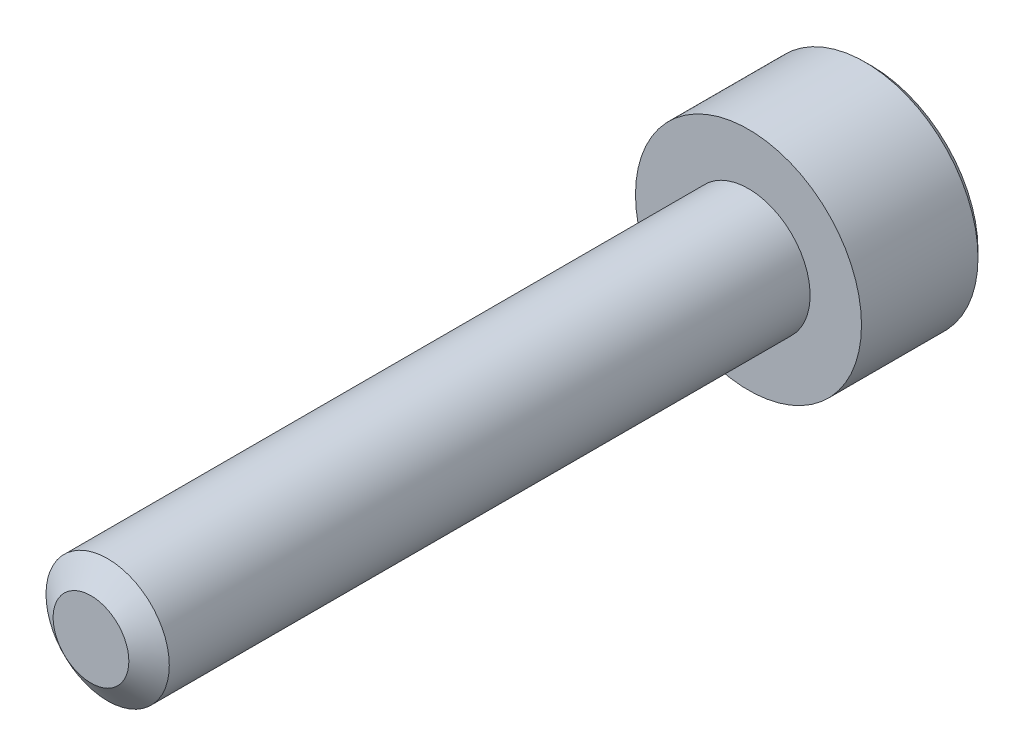
ISO-10303-21;
HEADER;
FILE_DESCRIPTION(('STEP AP214'),'2;1');
FILE_NAME('part.step','',(''),(''),'','','');
FILE_SCHEMA(('AUTOMOTIVE_DESIGN { 1 0 10303 214 1 1 1 1 }'));
ENDSEC;
DATA;
#1=APPLICATION_CONTEXT('core data for automotive mechanical design processes');
#2=APPLICATION_PROTOCOL_DEFINITION('international standard','automotive_design',2000,#1);
#3=PRODUCT_CONTEXT('',#1,'mechanical');
#4=PRODUCT('Part','Part','',(#3));
#5=PRODUCT_RELATED_PRODUCT_CATEGORY('part','',(#4));
#6=PRODUCT_DEFINITION_FORMATION('','',#4);
#7=PRODUCT_DEFINITION_CONTEXT('part definition',#1,'design');
#8=PRODUCT_DEFINITION('design','',#6,#7);
#9=PRODUCT_DEFINITION_SHAPE('','',#8);
#10=(LENGTH_UNIT() NAMED_UNIT(*) SI_UNIT(.MILLI.,.METRE.));
#11=(NAMED_UNIT(*) PLANE_ANGLE_UNIT() SI_UNIT($,.RADIAN.));
#12=(NAMED_UNIT(*) SI_UNIT($,.STERADIAN.) SOLID_ANGLE_UNIT());
#13=UNCERTAINTY_MEASURE_WITH_UNIT(LENGTH_MEASURE(1.E-05),#10,'distance_accuracy_value','');
#14=(GEOMETRIC_REPRESENTATION_CONTEXT(3) GLOBAL_UNCERTAINTY_ASSIGNED_CONTEXT((#13)) GLOBAL_UNIT_ASSIGNED_CONTEXT((#10,
#11,#12)) REPRESENTATION_CONTEXT('',''));
#15=CARTESIAN_POINT('',(0.,0.,0.));
#16=DIRECTION('',(0.,0.,1.));
#17=DIRECTION('',(1.,0.,0.));
#18=AXIS2_PLACEMENT_3D('',#15,#16,#17);
#19=CARTESIAN_POINT('',(0.,0.,4.));
#20=DIRECTION('',(0.,0.,1.));
#21=DIRECTION('',(0.,-1.,0.));
#22=AXIS2_PLACEMENT_3D('',#19,#20,#21);
#23=PLANE('',#22);
#24=CARTESIAN_POINT('',(0.,0.,4.));
#25=DIRECTION('',(0.,0.,1.));
#26=DIRECTION('',(1.,0.,0.));
#27=AXIS2_PLACEMENT_3D('',#24,#25,#26);
#28=CIRCLE('',#27,0.921240473580834);
#29=CARTESIAN_POINT('',(0.921240473580836,0.,4.));
#30=VERTEX_POINT('',#29);
#31=EDGE_CURVE('E11',#30,#30,#28,.T.);
#32=ORIENTED_EDGE('',*,*,#31,.T.);
#33=EDGE_LOOP('',(#32));
#34=FACE_BOUND('',#33,.T.);
#35=ADVANCED_FACE('F16',(#34),#23,.T.);
#36=CARTESIAN_POINT('',(0.,0.,4.));
#37=DIRECTION('',(0.,0.,-1.));
#38=DIRECTION('',(-1.,0.,0.));
#39=AXIS2_PLACEMENT_3D('',#36,#37,#38);
#40=CONICAL_SURFACE('',#39,0.921240473580834,0.959931088596884);
#41=CARTESIAN_POINT('',(0.,0.,3.59474821679062));
#42=DIRECTION('',(0.,0.,-1.));
#43=DIRECTION('',(1.,0.,0.));
#44=AXIS2_PLACEMENT_3D('',#41,#42,#43);
#45=CIRCLE('',#44,1.5);
#46=CARTESIAN_POINT('',(-1.5,0.,3.59474821679062));
#47=VERTEX_POINT('',#46);
#48=CARTESIAN_POINT('',(1.5,0.,3.59474821679062));
#49=VERTEX_POINT('',#48);
#50=EDGE_CURVE('E251',#47,#49,#45,.T.);
#51=ORIENTED_EDGE('',*,*,#50,.F.);
#52=CARTESIAN_POINT('',(0.,0.,3.59474821679062));
#53=DIRECTION('',(0.,0.,-1.));
#54=DIRECTION('',(1.,0.,0.));
#55=AXIS2_PLACEMENT_3D('',#52,#53,#54);
#56=CIRCLE('',#55,1.5);
#57=EDGE_CURVE('E255',#49,#47,#56,.T.);
#58=ORIENTED_EDGE('',*,*,#57,.F.);
#59=DIRECTION('',(-0.819152044288993,0.,0.573576436351044));
#60=VECTOR('',#59,1.);
#61=CARTESIAN_POINT('',(0.921240473580836,0.,4.));
#62=LINE('',#61,#60);
#63=EDGE_CURVE('E24',#49,#30,#62,.T.);
#64=ORIENTED_EDGE('',*,*,#63,.T.);
#65=ORIENTED_EDGE('',*,*,#31,.F.);
#66=ORIENTED_EDGE('',*,*,#63,.F.);
#67=EDGE_LOOP('',(#51,#58,#64,#65,#66));
#68=FACE_BOUND('',#67,.T.);
#69=ADVANCED_FACE('F265',(#68),#40,.T.);
#70=CARTESIAN_POINT('',(0.,0.,-12.));
#71=DIRECTION('',(0.,0.,1.));
#72=DIRECTION('',(1.,0.,0.));
#73=AXIS2_PLACEMENT_3D('',#70,#71,#72);
#74=CYLINDRICAL_SURFACE('',#73,1.5);
#75=ORIENTED_EDGE('',*,*,#50,.T.);
#76=ORIENTED_EDGE('',*,*,#57,.T.);
#77=DIRECTION('',(0.,0.,-1.));
#78=VECTOR('',#77,1.);
#79=CARTESIAN_POINT('',(-1.5,0.,-12.));
#80=LINE('',#79,#78);
#81=CARTESIAN_POINT('',(-1.5,0.,-12.));
#82=VERTEX_POINT('',#81);
#83=EDGE_CURVE('E261',#47,#82,#80,.T.);
#84=ORIENTED_EDGE('',*,*,#83,.T.);
#85=CARTESIAN_POINT('',(0.,0.,-12.));
#86=DIRECTION('',(0.,0.,1.));
#87=DIRECTION('',(1.,0.,0.));
#88=AXIS2_PLACEMENT_3D('',#85,#86,#87);
#89=CIRCLE('',#88,1.5);
#90=EDGE_CURVE('E239',#82,#82,#89,.T.);
#91=ORIENTED_EDGE('',*,*,#90,.T.);
#92=ORIENTED_EDGE('',*,*,#83,.F.);
#93=EDGE_LOOP('',(#75,#76,#84,#91,#92));
#94=FACE_BOUND('',#93,.T.);
#95=ADVANCED_FACE('F267',(#94),#74,.T.);
#96=CARTESIAN_POINT('',(0.,0.,-15.));
#97=DIRECTION('',(0.,0.,1.));
#98=DIRECTION('',(1.,0.,0.));
#99=AXIS2_PLACEMENT_3D('',#96,#97,#98);
#100=CONICAL_SURFACE('',#99,2.585,0.785398163397446);
#101=CARTESIAN_POINT('',(0.,0.,-14.835));
#102=DIRECTION('',(0.,0.,1.));
#103=DIRECTION('',(-1.,0.,0.));
#104=AXIS2_PLACEMENT_3D('',#101,#102,#103);
#105=CIRCLE('',#104,2.75);
#106=CARTESIAN_POINT('',(-2.75,0.,-14.835));
#107=VERTEX_POINT('',#106);
#108=EDGE_CURVE('E118',#107,#107,#105,.T.);
#109=ORIENTED_EDGE('',*,*,#108,.F.);
#110=DIRECTION('',(0.707106781186546,0.,-0.707106781186549));
#111=VECTOR('',#110,1.);
#112=CARTESIAN_POINT('',(-2.585,0.,-15.));
#113=LINE('',#112,#111);
#114=CARTESIAN_POINT('',(-2.585,0.,-15.));
#115=VERTEX_POINT('',#114);
#116=EDGE_CURVE('E250',#107,#115,#113,.T.);
#117=ORIENTED_EDGE('',*,*,#116,.T.);
#118=CARTESIAN_POINT('',(0.,0.,-15.));
#119=DIRECTION('',(0.,0.,-1.));
#120=DIRECTION('',(-1.,0.,0.));
#121=AXIS2_PLACEMENT_3D('',#118,#119,#120);
#122=CIRCLE('',#121,2.585);
#123=EDGE_CURVE('E243',#115,#115,#122,.T.);
#124=ORIENTED_EDGE('',*,*,#123,.F.);
#125=ORIENTED_EDGE('',*,*,#116,.F.);
#126=EDGE_LOOP('',(#109,#117,#124,#125));
#127=FACE_BOUND('',#126,.T.);
#128=ADVANCED_FACE('F294',(#127),#100,.T.);
#129=CARTESIAN_POINT('',(0.,0.,-15.));
#130=DIRECTION('',(0.,0.,-1.));
#131=DIRECTION('',(-1.,0.,0.));
#132=AXIS2_PLACEMENT_3D('',#129,#130,#131);
#133=CONICAL_SURFACE('',#132,1.44337567297406,0.78539816339745);
#134=CARTESIAN_POINT('',(-1.25,-0.72168783648703,-15.));
#135=CARTESIAN_POINT('',(-1.25,0.,-14.6391560817565));
#136=CARTESIAN_POINT('',(-1.25,0.721687836487026,-15.));
#137=(BOUNDED_CURVE() B_SPLINE_CURVE(2,(#134,#135,#136),.UNSPECIFIED.,.F.,
.F.) B_SPLINE_CURVE_WITH_KNOTS((3,3),(-0.355324362692751,-0.127655147271297),
.UNSPECIFIED.) CURVE() GEOMETRIC_REPRESENTATION_ITEM() RATIONAL_B_SPLINE_CURVE((1.37128129211021,
1.58341924626905,1.37128129211021)) REPRESENTATION_ITEM(''));
#138=CARTESIAN_POINT('',(-1.25,-0.721687836487032,-15.));
#139=VERTEX_POINT('',#138);
#140=CARTESIAN_POINT('',(-1.25,0.721687836487032,-15.));
#141=VERTEX_POINT('',#140);
#142=EDGE_CURVE('E175',#139,#141,#137,.T.);
#143=ORIENTED_EDGE('',*,*,#142,.F.);
#144=CARTESIAN_POINT('',(0.,0.,-15.));
#145=DIRECTION('',(0.,0.,-1.));
#146=DIRECTION('',(-1.,0.,0.));
#147=AXIS2_PLACEMENT_3D('',#144,#145,#146);
#148=CIRCLE('',#147,1.44337567297406);
#149=EDGE_CURVE('E247',#139,#141,#148,.T.);
#150=ORIENTED_EDGE('',*,*,#149,.T.);
#151=EDGE_LOOP('',(#143,#150));
#152=FACE_BOUND('',#151,.T.);
#153=ADVANCED_FACE('F282',(#152),#133,.F.);
#154=CARTESIAN_POINT('',(0.,0.,-15.));
#155=DIRECTION('',(0.,0.,-1.));
#156=DIRECTION('',(0.,-1.,0.));
#157=AXIS2_PLACEMENT_3D('',#154,#155,#156);
#158=PLANE('',#157);
#159=CARTESIAN_POINT('',(0.,0.,-15.));
#160=DIRECTION('',(0.,0.,-1.));
#161=DIRECTION('',(-1.,0.,0.));
#162=AXIS2_PLACEMENT_3D('',#159,#160,#161);
#163=CIRCLE('',#162,1.44337567297406);
#164=CARTESIAN_POINT('',(0.,1.44337567297407,-15.));
#165=VERTEX_POINT('',#164);
#166=EDGE_CURVE('E190',#141,#165,#163,.T.);
#167=ORIENTED_EDGE('',*,*,#166,.F.);
#168=ORIENTED_EDGE('',*,*,#149,.F.);
#169=CARTESIAN_POINT('',(0.,0.,-15.));
#170=DIRECTION('',(0.,0.,-1.));
#171=DIRECTION('',(-1.,0.,0.));
#172=AXIS2_PLACEMENT_3D('',#169,#170,#171);
#173=CIRCLE('',#172,1.44337567297406);
#174=CARTESIAN_POINT('',(0.,-1.44337567297407,-15.));
#175=VERTEX_POINT('',#174);
#176=EDGE_CURVE('E182',#175,#139,#173,.T.);
#177=ORIENTED_EDGE('',*,*,#176,.F.);
#178=CARTESIAN_POINT('',(0.,0.,-15.));
#179=DIRECTION('',(0.,0.,-1.));
#180=DIRECTION('',(-1.,0.,0.));
#181=AXIS2_PLACEMENT_3D('',#178,#179,#180);
#182=CIRCLE('',#181,1.44337567297406);
#183=CARTESIAN_POINT('',(1.25,-0.721687836487032,-15.));
#184=VERTEX_POINT('',#183);
#185=EDGE_CURVE('E189',#184,#175,#182,.T.);
#186=ORIENTED_EDGE('',*,*,#185,.F.);
#187=CARTESIAN_POINT('',(0.,0.,-15.));
#188=DIRECTION('',(0.,0.,-1.));
#189=DIRECTION('',(-1.,0.,0.));
#190=AXIS2_PLACEMENT_3D('',#187,#188,#189);
#191=CIRCLE('',#190,1.44337567297406);
#192=CARTESIAN_POINT('',(1.25,0.721687836487033,-15.));
#193=VERTEX_POINT('',#192);
#194=EDGE_CURVE('E233',#193,#184,#191,.T.);
#195=ORIENTED_EDGE('',*,*,#194,.F.);
#196=CARTESIAN_POINT('',(0.,0.,-15.));
#197=DIRECTION('',(0.,0.,-1.));
#198=DIRECTION('',(-1.,0.,0.));
#199=AXIS2_PLACEMENT_3D('',#196,#197,#198);
#200=CIRCLE('',#199,1.44337567297406);
#201=EDGE_CURVE('E236',#165,#193,#200,.T.);
#202=ORIENTED_EDGE('',*,*,#201,.F.);
#203=EDGE_LOOP('',(#167,#168,#177,#186,#195,#202));
#204=FACE_BOUND('',#203,.T.);
#205=ORIENTED_EDGE('',*,*,#123,.T.);
#206=EDGE_LOOP('',(#205));
#207=FACE_BOUND('',#206,.T.);
#208=ADVANCED_FACE('F272',(#204,#207),#158,.T.);
#209=CARTESIAN_POINT('',(0.,0.,-12.));
#210=DIRECTION('',(0.,0.,-1.));
#211=DIRECTION('',(0.,-1.,0.));
#212=AXIS2_PLACEMENT_3D('',#209,#210,#211);
#213=PLANE('',#212);
#214=ORIENTED_EDGE('',*,*,#90,.F.);
#215=EDGE_LOOP('',(#214));
#216=FACE_BOUND('',#215,.T.);
#217=CARTESIAN_POINT('',(0.,0.,-12.));
#218=DIRECTION('',(0.,0.,1.));
#219=DIRECTION('',(1.,0.,0.));
#220=AXIS2_PLACEMENT_3D('',#217,#218,#219);
#221=CIRCLE('',#220,2.75);
#222=CARTESIAN_POINT('',(-2.75,0.,-12.));
#223=VERTEX_POINT('',#222);
#224=EDGE_CURVE('E116',#223,#223,#221,.T.);
#225=ORIENTED_EDGE('',*,*,#224,.T.);
#226=EDGE_LOOP('',(#225));
#227=FACE_BOUND('',#226,.T.);
#228=ADVANCED_FACE('F122',(#216,#227),#213,.F.);
#229=CARTESIAN_POINT('',(0.,0.,-15.));
#230=DIRECTION('',(0.,0.,-1.));
#231=DIRECTION('',(-1.,0.,0.));
#232=AXIS2_PLACEMENT_3D('',#229,#230,#231);
#233=CONICAL_SURFACE('',#232,1.44337567297406,0.78539816339745);
#234=ORIENTED_EDGE('',*,*,#201,.T.);
#235=CARTESIAN_POINT('',(0.,1.44337567297406,-15.));
#236=CARTESIAN_POINT('',(0.625000000000001,1.08253175473055,-14.6391560817565));
#237=CARTESIAN_POINT('',(1.25,0.721687836487035,-15.));
#238=(BOUNDED_CURVE() B_SPLINE_CURVE(2,(#235,#236,#237),.UNSPECIFIED.,.F.,
.F.) B_SPLINE_CURVE_WITH_KNOTS((3,3),(-0.35532436269275,-0.127655147271297),
.UNSPECIFIED.) CURVE() GEOMETRIC_REPRESENTATION_ITEM() RATIONAL_B_SPLINE_CURVE((1.37128129211021,
1.58341924626904,1.3712812921102)) REPRESENTATION_ITEM(''));
#239=EDGE_CURVE('E170',#165,#193,#238,.T.);
#240=ORIENTED_EDGE('',*,*,#239,.F.);
#241=EDGE_LOOP('',(#234,#240));
#242=FACE_BOUND('',#241,.T.);
#243=ADVANCED_FACE('F271',(#242),#233,.F.);
#244=CARTESIAN_POINT('',(0.,0.,-15.));
#245=DIRECTION('',(0.,0.,-1.));
#246=DIRECTION('',(1.,0.,0.));
#247=AXIS2_PLACEMENT_3D('',#244,#245,#246);
#248=CONICAL_SURFACE('',#247,1.44337567297406,0.78539816339745);
#249=ORIENTED_EDGE('',*,*,#194,.T.);
#250=CARTESIAN_POINT('',(1.25,0.721687836487025,-15.));
#251=CARTESIAN_POINT('',(1.25,0.,-14.6391560817565));
#252=CARTESIAN_POINT('',(1.25,-0.721687836487027,-15.));
#253=(BOUNDED_CURVE() B_SPLINE_CURVE(2,(#250,#251,#252),.UNSPECIFIED.,.F.,
.F.) B_SPLINE_CURVE_WITH_KNOTS((3,3),(-0.35532436269275,-0.127655147271297),
.UNSPECIFIED.) CURVE() GEOMETRIC_REPRESENTATION_ITEM() RATIONAL_B_SPLINE_CURVE((1.3712812921102,
1.58341924626904,1.3712812921102)) REPRESENTATION_ITEM(''));
#254=EDGE_CURVE('E171',#193,#184,#253,.T.);
#255=ORIENTED_EDGE('',*,*,#254,.F.);
#256=EDGE_LOOP('',(#249,#255));
#257=FACE_BOUND('',#256,.T.);
#258=ADVANCED_FACE('F279',(#257),#248,.F.);
#259=CARTESIAN_POINT('',(0.,0.,-15.));
#260=DIRECTION('',(0.,0.,-1.));
#261=DIRECTION('',(-1.,0.,0.));
#262=AXIS2_PLACEMENT_3D('',#259,#260,#261);
#263=CONICAL_SURFACE('',#262,1.44337567297406,0.78539816339745);
#264=ORIENTED_EDGE('',*,*,#185,.T.);
#265=CARTESIAN_POINT('',(1.25,-0.721687836487034,-15.));
#266=CARTESIAN_POINT('',(0.625000000000001,-1.08253175473055,-14.6391560817565));
#267=CARTESIAN_POINT('',(0.,-1.44337567297406,-15.));
#268=(BOUNDED_CURVE() B_SPLINE_CURVE(2,(#265,#266,#267),.UNSPECIFIED.,.F.,
.F.) B_SPLINE_CURVE_WITH_KNOTS((3,3),(-0.355324362692751,-0.127655147271297),
.UNSPECIFIED.) CURVE() GEOMETRIC_REPRESENTATION_ITEM() RATIONAL_B_SPLINE_CURVE((1.37128129211021,
1.58341924626905,1.37128129211021)) REPRESENTATION_ITEM(''));
#269=EDGE_CURVE('E128',#184,#175,#268,.T.);
#270=ORIENTED_EDGE('',*,*,#269,.F.);
#271=EDGE_LOOP('',(#264,#270));
#272=FACE_BOUND('',#271,.T.);
#273=ADVANCED_FACE('F302',(#272),#263,.F.);
#274=CARTESIAN_POINT('',(0.,0.,-15.));
#275=DIRECTION('',(0.,0.,-1.));
#276=DIRECTION('',(-1.,0.,0.));
#277=AXIS2_PLACEMENT_3D('',#274,#275,#276);
#278=CONICAL_SURFACE('',#277,1.44337567297406,0.78539816339745);
#279=ORIENTED_EDGE('',*,*,#176,.T.);
#280=CARTESIAN_POINT('',(0.,-1.44337567297406,-15.));
#281=CARTESIAN_POINT('',(-0.625000000000001,-1.08253175473055,-14.6391560817565));
#282=CARTESIAN_POINT('',(-1.25,-0.721687836487035,-15.));
#283=(BOUNDED_CURVE() B_SPLINE_CURVE(2,(#280,#281,#282),.UNSPECIFIED.,.F.,
.F.) B_SPLINE_CURVE_WITH_KNOTS((3,3),(-0.35532436269275,-0.127655147271297),
.UNSPECIFIED.) CURVE() GEOMETRIC_REPRESENTATION_ITEM() RATIONAL_B_SPLINE_CURVE((1.37128129211021,
1.58341924626904,1.3712812921102)) REPRESENTATION_ITEM(''));
#284=EDGE_CURVE('E142',#175,#139,#283,.T.);
#285=ORIENTED_EDGE('',*,*,#284,.F.);
#286=EDGE_LOOP('',(#279,#285));
#287=FACE_BOUND('',#286,.T.);
#288=ADVANCED_FACE('F306',(#287),#278,.F.);
#289=CARTESIAN_POINT('',(0.,0.,-15.));
#290=DIRECTION('',(0.,0.,-1.));
#291=DIRECTION('',(-1.,0.,0.));
#292=AXIS2_PLACEMENT_3D('',#289,#290,#291);
#293=CONICAL_SURFACE('',#292,1.44337567297406,0.78539816339745);
#294=ORIENTED_EDGE('',*,*,#166,.T.);
#295=CARTESIAN_POINT('',(-1.25,0.721687836487036,-15.));
#296=CARTESIAN_POINT('',(-0.625,1.08253175473055,-14.6391560817565));
#297=CARTESIAN_POINT('',(0.,1.44337567297406,-15.));
#298=(BOUNDED_CURVE() B_SPLINE_CURVE(2,(#295,#296,#297),.UNSPECIFIED.,.F.,
.F.) B_SPLINE_CURVE_WITH_KNOTS((3,3),(-0.35532436269275,-0.127655147271297),
.UNSPECIFIED.) CURVE() GEOMETRIC_REPRESENTATION_ITEM() RATIONAL_B_SPLINE_CURVE((1.3712812921102,
1.58341924626904,1.3712812921102)) REPRESENTATION_ITEM(''));
#299=EDGE_CURVE('E141',#141,#165,#298,.T.);
#300=ORIENTED_EDGE('',*,*,#299,.F.);
#301=EDGE_LOOP('',(#294,#300));
#302=FACE_BOUND('',#301,.T.);
#303=ADVANCED_FACE('F308',(#302),#293,.F.);
#304=CARTESIAN_POINT('',(1.25,2.1650635094611,-13.125));
#305=DIRECTION('',(0.,0.,-1.));
#306=DIRECTION('',(0.,-1.,0.));
#307=AXIS2_PLACEMENT_3D('',#304,#305,#306);
#308=PLANE('',#307);
#309=DIRECTION('',(0.866025403784439,0.5,0.));
#310=VECTOR('',#309,1.);
#311=CARTESIAN_POINT('',(-1.25,0.721687836487032,-13.125));
#312=LINE('',#311,#310);
#313=CARTESIAN_POINT('',(-1.25,0.721687836487032,-13.125));
#314=VERTEX_POINT('',#313);
#315=CARTESIAN_POINT('',(0.,1.44337567297406,-13.125));
#316=VERTEX_POINT('',#315);
#317=EDGE_CURVE('E132',#314,#316,#312,.T.);
#318=ORIENTED_EDGE('',*,*,#317,.T.);
#319=DIRECTION('',(0.866025403784439,-0.5,0.));
#320=VECTOR('',#319,1.);
#321=CARTESIAN_POINT('',(0.,1.44337567297406,-13.125));
#322=LINE('',#321,#320);
#323=CARTESIAN_POINT('',(1.25,0.721687836487032,-13.125));
#324=VERTEX_POINT('',#323);
#325=EDGE_CURVE('E222',#316,#324,#322,.T.);
#326=ORIENTED_EDGE('',*,*,#325,.T.);
#327=DIRECTION('',(0.,-1.,0.));
#328=VECTOR('',#327,1.);
#329=CARTESIAN_POINT('',(1.25,0.721687836487032,-13.125));
#330=LINE('',#329,#328);
#331=CARTESIAN_POINT('',(1.25,-0.721687836487033,-13.125));
#332=VERTEX_POINT('',#331);
#333=EDGE_CURVE('E164',#324,#332,#330,.T.);
#334=ORIENTED_EDGE('',*,*,#333,.T.);
#335=DIRECTION('',(-0.866025403784439,-0.5,0.));
#336=VECTOR('',#335,1.);
#337=CARTESIAN_POINT('',(1.25,-0.721687836487033,-13.125));
#338=LINE('',#337,#336);
#339=CARTESIAN_POINT('',(0.,-1.44337567297406,-13.125));
#340=VERTEX_POINT('',#339);
#341=EDGE_CURVE('E202',#332,#340,#338,.T.);
#342=ORIENTED_EDGE('',*,*,#341,.T.);
#343=DIRECTION('',(-0.866025403784439,0.5,0.));
#344=VECTOR('',#343,1.);
#345=CARTESIAN_POINT('',(0.,-1.44337567297406,-13.125));
#346=LINE('',#345,#344);
#347=CARTESIAN_POINT('',(-1.25,-0.721687836487032,-13.125));
#348=VERTEX_POINT('',#347);
#349=EDGE_CURVE('E148',#340,#348,#346,.T.);
#350=ORIENTED_EDGE('',*,*,#349,.T.);
#351=DIRECTION('',(0.,1.,0.));
#352=VECTOR('',#351,1.);
#353=CARTESIAN_POINT('',(-1.25,-0.721687836487032,-13.125));
#354=LINE('',#353,#352);
#355=EDGE_CURVE('E181',#348,#314,#354,.T.);
#356=ORIENTED_EDGE('',*,*,#355,.T.);
#357=EDGE_LOOP('',(#318,#326,#334,#342,#350,#356));
#358=FACE_BOUND('',#357,.T.);
#359=ADVANCED_FACE('F311',(#358),#308,.T.);
#360=CARTESIAN_POINT('',(0.,1.44337567297406,-13.125));
#361=DIRECTION('',(0.5,0.866025403784439,0.));
#362=DIRECTION('',(0.,0.,-1.));
#363=AXIS2_PLACEMENT_3D('',#360,#361,#362);
#364=PLANE('',#363);
#365=DIRECTION('',(0.,0.,-1.));
#366=VECTOR('',#365,1.);
#367=CARTESIAN_POINT('',(0.,1.44337567297406,-13.125));
#368=LINE('',#367,#366);
#369=EDGE_CURVE('E137',#316,#165,#368,.T.);
#370=ORIENTED_EDGE('',*,*,#369,.T.);
#371=ORIENTED_EDGE('',*,*,#239,.T.);
#372=DIRECTION('',(0.,0.,-1.));
#373=VECTOR('',#372,1.);
#374=CARTESIAN_POINT('',(1.25,0.721687836487032,-13.125));
#375=LINE('',#374,#373);
#376=EDGE_CURVE('E205',#324,#193,#375,.T.);
#377=ORIENTED_EDGE('',*,*,#376,.F.);
#378=ORIENTED_EDGE('',*,*,#325,.F.);
#379=EDGE_LOOP('',(#370,#371,#377,#378));
#380=FACE_BOUND('',#379,.T.);
#381=ADVANCED_FACE('F315',(#380),#364,.F.);
#382=CARTESIAN_POINT('',(1.25,0.721687836487032,-13.125));
#383=DIRECTION('',(1.,0.,0.));
#384=DIRECTION('',(0.,1.,0.));
#385=AXIS2_PLACEMENT_3D('',#382,#383,#384);
#386=PLANE('',#385);
#387=ORIENTED_EDGE('',*,*,#376,.T.);
#388=ORIENTED_EDGE('',*,*,#254,.T.);
#389=DIRECTION('',(0.,0.,-1.));
#390=VECTOR('',#389,1.);
#391=CARTESIAN_POINT('',(1.25,-0.721687836487033,-13.125));
#392=LINE('',#391,#390);
#393=EDGE_CURVE('E198',#332,#184,#392,.T.);
#394=ORIENTED_EDGE('',*,*,#393,.F.);
#395=ORIENTED_EDGE('',*,*,#333,.F.);
#396=EDGE_LOOP('',(#387,#388,#394,#395));
#397=FACE_BOUND('',#396,.T.);
#398=ADVANCED_FACE('F317',(#397),#386,.F.);
#399=CARTESIAN_POINT('',(1.25,-0.721687836487033,-13.125));
#400=DIRECTION('',(0.5,-0.866025403784439,0.));
#401=DIRECTION('',(0.,0.,-1.));
#402=AXIS2_PLACEMENT_3D('',#399,#400,#401);
#403=PLANE('',#402);
#404=ORIENTED_EDGE('',*,*,#393,.T.);
#405=ORIENTED_EDGE('',*,*,#269,.T.);
#406=DIRECTION('',(0.,0.,-1.));
#407=VECTOR('',#406,1.);
#408=CARTESIAN_POINT('',(0.,-1.44337567297406,-13.125));
#409=LINE('',#408,#407);
#410=EDGE_CURVE('E149',#340,#175,#409,.T.);
#411=ORIENTED_EDGE('',*,*,#410,.F.);
#412=ORIENTED_EDGE('',*,*,#341,.F.);
#413=EDGE_LOOP('',(#404,#405,#411,#412));
#414=FACE_BOUND('',#413,.T.);
#415=ADVANCED_FACE('F323',(#414),#403,.F.);
#416=CARTESIAN_POINT('',(0.,-1.44337567297406,-13.125));
#417=DIRECTION('',(-0.5,-0.866025403784439,0.));
#418=DIRECTION('',(-0.866025403784439,0.5,0.));
#419=AXIS2_PLACEMENT_3D('',#416,#417,#418);
#420=PLANE('',#419);
#421=ORIENTED_EDGE('',*,*,#410,.T.);
#422=ORIENTED_EDGE('',*,*,#284,.T.);
#423=DIRECTION('',(0.,0.,-1.));
#424=VECTOR('',#423,1.);
#425=CARTESIAN_POINT('',(-1.25,-0.721687836487032,-13.125));
#426=LINE('',#425,#424);
#427=EDGE_CURVE('E136',#348,#139,#426,.T.);
#428=ORIENTED_EDGE('',*,*,#427,.F.);
#429=ORIENTED_EDGE('',*,*,#349,.F.);
#430=EDGE_LOOP('',(#421,#422,#428,#429));
#431=FACE_BOUND('',#430,.T.);
#432=ADVANCED_FACE('F351',(#431),#420,.F.);
#433=CARTESIAN_POINT('',(-1.25,-0.721687836487032,-13.125));
#434=DIRECTION('',(-1.,0.,0.));
#435=DIRECTION('',(0.,0.,1.));
#436=AXIS2_PLACEMENT_3D('',#433,#434,#435);
#437=PLANE('',#436);
#438=ORIENTED_EDGE('',*,*,#427,.T.);
#439=ORIENTED_EDGE('',*,*,#142,.T.);
#440=DIRECTION('',(0.,0.,-1.));
#441=VECTOR('',#440,1.);
#442=CARTESIAN_POINT('',(-1.25,0.721687836487032,-13.125));
#443=LINE('',#442,#441);
#444=EDGE_CURVE('E155',#314,#141,#443,.T.);
#445=ORIENTED_EDGE('',*,*,#444,.F.);
#446=ORIENTED_EDGE('',*,*,#355,.F.);
#447=EDGE_LOOP('',(#438,#439,#445,#446));
#448=FACE_BOUND('',#447,.T.);
#449=ADVANCED_FACE('F356',(#448),#437,.F.);
#450=CARTESIAN_POINT('',(-1.25,0.721687836487032,-13.125));
#451=DIRECTION('',(-0.5,0.866025403784439,0.));
#452=DIRECTION('',(0.,0.,1.));
#453=AXIS2_PLACEMENT_3D('',#450,#451,#452);
#454=PLANE('',#453);
#455=ORIENTED_EDGE('',*,*,#444,.T.);
#456=ORIENTED_EDGE('',*,*,#299,.T.);
#457=ORIENTED_EDGE('',*,*,#369,.F.);
#458=ORIENTED_EDGE('',*,*,#317,.F.);
#459=EDGE_LOOP('',(#455,#456,#457,#458));
#460=FACE_BOUND('',#459,.T.);
#461=ADVANCED_FACE('F334',(#460),#454,.F.);
#462=CARTESIAN_POINT('',(0.,0.,-15.));
#463=DIRECTION('',(0.,0.,1.));
#464=DIRECTION('',(1.,0.,0.));
#465=AXIS2_PLACEMENT_3D('',#462,#463,#464);
#466=CYLINDRICAL_SURFACE('',#465,2.75);
#467=ORIENTED_EDGE('',*,*,#224,.F.);
#468=DIRECTION('',(0.,0.,-1.));
#469=VECTOR('',#468,1.);
#470=CARTESIAN_POINT('',(-2.75,0.,-15.));
#471=LINE('',#470,#469);
#472=EDGE_CURVE('E113',#223,#107,#471,.T.);
#473=ORIENTED_EDGE('',*,*,#472,.T.);
#474=ORIENTED_EDGE('',*,*,#108,.T.);
#475=ORIENTED_EDGE('',*,*,#472,.F.);
#476=EDGE_LOOP('',(#467,#473,#474,#475));
#477=FACE_BOUND('',#476,.T.);
#478=ADVANCED_FACE('F115',(#477),#466,.T.);
#479=CLOSED_SHELL('',(#35,#69,#95,#128,#153,#208,#228,#243,#258,#273,#288,#303,#359,#381,#398,
#415,#432,#449,#461,#478));
#480=MANIFOLD_SOLID_BREP('B1',#479);
#481=ADVANCED_BREP_SHAPE_REPRESENTATION('',(#18,#480),#14);
#482=SHAPE_DEFINITION_REPRESENTATION(#9,#481);
ENDSEC;
END-ISO-10303-21;
